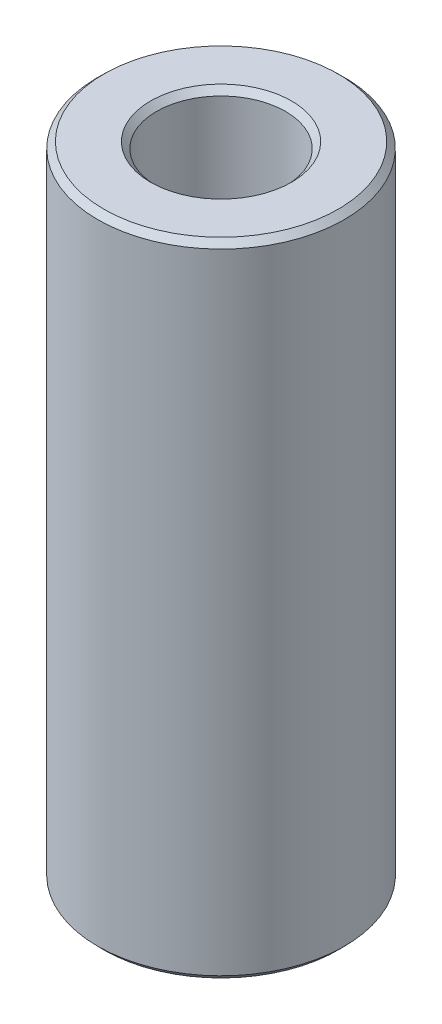
ISO-10303-21;
HEADER;
FILE_DESCRIPTION(('STEP AP214'),'2;1');
FILE_NAME('part.step','',(''),(''),'','','');
FILE_SCHEMA(('AUTOMOTIVE_DESIGN { 1 0 10303 214 1 1 1 1 }'));
ENDSEC;
DATA;
#1=APPLICATION_CONTEXT('core data for automotive mechanical design processes');
#2=APPLICATION_PROTOCOL_DEFINITION('international standard','automotive_design',2000,#1);
#3=PRODUCT_CONTEXT('',#1,'mechanical');
#4=PRODUCT('Part','Part','',(#3));
#5=PRODUCT_RELATED_PRODUCT_CATEGORY('part','',(#4));
#6=PRODUCT_DEFINITION_FORMATION('','',#4);
#7=PRODUCT_DEFINITION_CONTEXT('part definition',#1,'design');
#8=PRODUCT_DEFINITION('design','',#6,#7);
#9=PRODUCT_DEFINITION_SHAPE('','',#8);
#10=(LENGTH_UNIT() NAMED_UNIT(*) SI_UNIT(.MILLI.,.METRE.));
#11=(NAMED_UNIT(*) PLANE_ANGLE_UNIT() SI_UNIT($,.RADIAN.));
#12=(NAMED_UNIT(*) SI_UNIT($,.STERADIAN.) SOLID_ANGLE_UNIT());
#13=UNCERTAINTY_MEASURE_WITH_UNIT(LENGTH_MEASURE(1.E-05),#10,'distance_accuracy_value','');
#14=(GEOMETRIC_REPRESENTATION_CONTEXT(3) GLOBAL_UNCERTAINTY_ASSIGNED_CONTEXT((#13)) GLOBAL_UNIT_ASSIGNED_CONTEXT((#10,
#11,#12)) REPRESENTATION_CONTEXT('',''));
#15=CARTESIAN_POINT('',(0.,0.,0.));
#16=DIRECTION('',(0.,0.,1.));
#17=DIRECTION('',(1.,0.,0.));
#18=AXIS2_PLACEMENT_3D('',#15,#16,#17);
#19=CARTESIAN_POINT('',(0.,52.029353738122,0.));
#20=DIRECTION('',(0.,-1.,0.));
#21=DIRECTION('',(0.,0.,-1.));
#22=AXIS2_PLACEMENT_3D('',#19,#20,#21);
#23=CYLINDRICAL_SURFACE('',#22,10.);
#24=CARTESIAN_POINT('',(0.,0.496036833651431,0.));
#25=DIRECTION('',(0.,1.,0.));
#26=DIRECTION('',(0.,0.,1.));
#27=AXIS2_PLACEMENT_3D('',#24,#25,#26);
#28=CIRCLE('',#27,10.);
#29=CARTESIAN_POINT('',(0.,0.496036833651431,10.));
#30=VERTEX_POINT('',#29);
#31=EDGE_CURVE('E10',#30,#30,#28,.T.);
#32=ORIENTED_EDGE('',*,*,#31,.T.);
#33=EDGE_LOOP('',(#32));
#34=FACE_BOUND('',#33,.T.);
#35=CARTESIAN_POINT('',(0.,51.5460444635213,0.));
#36=DIRECTION('',(0.,1.,0.));
#37=DIRECTION('',(0.,0.,1.));
#38=AXIS2_PLACEMENT_3D('',#35,#36,#37);
#39=CIRCLE('',#38,10.);
#40=CARTESIAN_POINT('',(0.,51.5460444635213,10.));
#41=VERTEX_POINT('',#40);
#42=EDGE_CURVE('E50',#41,#41,#39,.F.);
#43=ORIENTED_EDGE('',*,*,#42,.T.);
#44=EDGE_LOOP('',(#43));
#45=FACE_BOUND('',#44,.T.);
#46=ADVANCED_FACE('F39',(#34,#45),#23,.T.);
#47=CARTESIAN_POINT('',(0.,52.029353738122,0.));
#48=DIRECTION('',(0.,1.,0.));
#49=DIRECTION('',(0.,0.,1.));
#50=AXIS2_PLACEMENT_3D('',#47,#48,#49);
#51=PLANE('',#50);
#52=CARTESIAN_POINT('',(0.,52.029353738122,0.));
#53=DIRECTION('',(0.,1.,0.));
#54=DIRECTION('',(0.,0.,1.));
#55=AXIS2_PLACEMENT_3D('',#52,#53,#54);
#56=CIRCLE('',#55,5.71759016979764);
#57=CARTESIAN_POINT('',(0.,52.029353738122,5.71759016979764));
#58=VERTEX_POINT('',#57);
#59=EDGE_CURVE('E58',#58,#58,#56,.F.);
#60=ORIENTED_EDGE('',*,*,#59,.T.);
#61=EDGE_LOOP('',(#60));
#62=FACE_BOUND('',#61,.T.);
#63=CARTESIAN_POINT('',(0.,52.029353738122,0.));
#64=DIRECTION('',(0.,1.,0.));
#65=DIRECTION('',(0.,0.,1.));
#66=AXIS2_PLACEMENT_3D('',#63,#64,#65);
#67=CIRCLE('',#66,9.50396316634857);
#68=CARTESIAN_POINT('',(0.,52.029353738122,9.50396316634857));
#69=VERTEX_POINT('',#68);
#70=EDGE_CURVE('E61',#69,#69,#67,.T.);
#71=ORIENTED_EDGE('',*,*,#70,.T.);
#72=EDGE_LOOP('',(#71));
#73=FACE_BOUND('',#72,.T.);
#74=ADVANCED_FACE('F88',(#62,#73),#51,.T.);
#75=CARTESIAN_POINT('',(0.,0.,0.));
#76=DIRECTION('',(0.,1.,0.));
#77=DIRECTION('',(0.,0.,1.));
#78=AXIS2_PLACEMENT_3D('',#75,#76,#77);
#79=PLANE('',#78);
#80=CARTESIAN_POINT('',(0.,0.,0.));
#81=DIRECTION('',(0.,1.,0.));
#82=DIRECTION('',(0.,0.,1.));
#83=AXIS2_PLACEMENT_3D('',#80,#81,#82);
#84=CIRCLE('',#83,5.73031772884836);
#85=CARTESIAN_POINT('',(0.,0.,-5.73031772884836));
#86=VERTEX_POINT('',#85);
#87=EDGE_CURVE('E51',#86,#86,#84,.T.);
#88=ORIENTED_EDGE('',*,*,#87,.T.);
#89=EDGE_LOOP('',(#88));
#90=FACE_BOUND('',#89,.T.);
#91=CARTESIAN_POINT('',(0.,0.,0.));
#92=DIRECTION('',(0.,1.,0.));
#93=DIRECTION('',(0.,0.,1.));
#94=AXIS2_PLACEMENT_3D('',#91,#92,#93);
#95=CIRCLE('',#94,9.51669072539929);
#96=CARTESIAN_POINT('',(0.,0.,9.51669072539929));
#97=VERTEX_POINT('',#96);
#98=EDGE_CURVE('E54',#97,#97,#95,.F.);
#99=ORIENTED_EDGE('',*,*,#98,.T.);
#100=EDGE_LOOP('',(#99));
#101=FACE_BOUND('',#100,.T.);
#102=ADVANCED_FACE('F83',(#90,#101),#79,.F.);
#103=CARTESIAN_POINT('',(0.,52.029353738122,0.));
#104=DIRECTION('',(0.,-1.,0.));
#105=DIRECTION('',(0.,0.,-1.));
#106=AXIS2_PLACEMENT_3D('',#103,#104,#105);
#107=CYLINDRICAL_SURFACE('',#106,5.23428089519693);
#108=CARTESIAN_POINT('',(0.,51.5333169044706,0.));
#109=DIRECTION('',(0.,1.,0.));
#110=DIRECTION('',(0.,0.,1.));
#111=AXIS2_PLACEMENT_3D('',#108,#109,#110);
#112=CIRCLE('',#111,5.23428089519693);
#113=CARTESIAN_POINT('',(0.,51.5333169044706,5.23428089519693));
#114=VERTEX_POINT('',#113);
#115=EDGE_CURVE('E67',#114,#114,#112,.T.);
#116=ORIENTED_EDGE('',*,*,#115,.T.);
#117=EDGE_LOOP('',(#116));
#118=FACE_BOUND('',#117,.T.);
#119=CARTESIAN_POINT('',(0.,0.483309274600704,0.));
#120=DIRECTION('',(0.,1.,0.));
#121=DIRECTION('',(0.,0.,1.));
#122=AXIS2_PLACEMENT_3D('',#119,#120,#121);
#123=CIRCLE('',#122,5.23428089519693);
#124=CARTESIAN_POINT('',(0.,0.483309274600704,-5.23428089519693));
#125=VERTEX_POINT('',#124);
#126=EDGE_CURVE('E69',#125,#125,#123,.F.);
#127=ORIENTED_EDGE('',*,*,#126,.T.);
#128=EDGE_LOOP('',(#127));
#129=FACE_BOUND('',#128,.T.);
#130=ADVANCED_FACE('F71',(#118,#129),#107,.F.);
#131=CARTESIAN_POINT('',(0.,51.5333169044706,0.));
#132=DIRECTION('',(0.,1.,0.));
#133=DIRECTION('',(0.,0.,1.));
#134=AXIS2_PLACEMENT_3D('',#131,#132,#133);
#135=CONICAL_SURFACE('',#134,5.23428089519693,0.772402918433484);
#136=ORIENTED_EDGE('',*,*,#59,.F.);
#137=EDGE_LOOP('',(#136));
#138=FACE_BOUND('',#137,.T.);
#139=ORIENTED_EDGE('',*,*,#115,.F.);
#140=EDGE_LOOP('',(#139));
#141=FACE_BOUND('',#140,.T.);
#142=ADVANCED_FACE('F77',(#138,#141),#135,.F.);
#143=CARTESIAN_POINT('',(0.,0.,0.));
#144=DIRECTION('',(0.,-1.,0.));
#145=DIRECTION('',(0.,0.,-1.));
#146=AXIS2_PLACEMENT_3D('',#143,#144,#145);
#147=CONICAL_SURFACE('',#146,5.73031772884836,0.798393408361418);
#148=CARTESIAN_POINT('',(0.,0.483309274600704,-5.23428089519693));
#149=CARTESIAN_POINT('',(0.,0.47827480299028,-5.23944794554746));
#150=CARTESIAN_POINT('',(0.,0.473240331379856,-5.244614995898));
#151=CARTESIAN_POINT('',(0.,0.463171388159008,-5.25494909659907));
#152=CARTESIAN_POINT('',(0.,0.458136916548584,-5.26011614694961));
#153=CARTESIAN_POINT('',(0.,0.448067973327736,-5.27045024765068));
#154=CARTESIAN_POINT('',(0.,0.443033501717312,-5.27561729800121));
#155=CARTESIAN_POINT('',(0.,0.432964558496464,-5.28595139870229));
#156=CARTESIAN_POINT('',(0.,0.42793008688604,-5.29111844905282));
#157=CARTESIAN_POINT('',(0.,0.417861143665192,-5.30145254975389));
#158=CARTESIAN_POINT('',(0.,0.412826672054768,-5.30661960010443));
#159=CARTESIAN_POINT('',(0.,0.40275772883392,-5.3169537008055));
#160=CARTESIAN_POINT('',(0.,0.397723257223496,-5.32212075115604));
#161=CARTESIAN_POINT('',(0.,0.387654314002648,-5.33245485185711));
#162=CARTESIAN_POINT('',(0.,0.382619842392224,-5.33762190220764));
#163=CARTESIAN_POINT('',(0.,0.372550899171376,-5.34795600290872));
#164=CARTESIAN_POINT('',(0.,0.367516427560952,-5.35312305325925));
#165=CARTESIAN_POINT('',(0.,0.357447484340104,-5.36345715396032));
#166=CARTESIAN_POINT('',(0.,0.35241301272968,-5.36862420431086));
#167=CARTESIAN_POINT('',(0.,0.342344069508832,-5.37895830501193));
#168=CARTESIAN_POINT('',(0.,0.337309597898408,-5.38412535536247));
#169=CARTESIAN_POINT('',(0.,0.32724065467756,-5.39445945606354));
#170=CARTESIAN_POINT('',(0.,0.322206183067136,-5.39962650641407));
#171=CARTESIAN_POINT('',(0.,0.312137239846288,-5.40996060711514));
#172=CARTESIAN_POINT('',(0.,0.307102768235864,-5.41512765746568));
#173=CARTESIAN_POINT('',(0.,0.297033825015016,-5.42546175816675));
#174=CARTESIAN_POINT('',(0.,0.291999353404592,-5.43062880851729));
#175=CARTESIAN_POINT('',(0.,0.281930410183744,-5.44096290921836));
#176=CARTESIAN_POINT('',(0.,0.27689593857332,-5.44612995956889));
#177=CARTESIAN_POINT('',(0.,0.266826995352472,-5.45646406026997));
#178=CARTESIAN_POINT('',(0.,0.261792523742048,-5.4616311106205));
#179=CARTESIAN_POINT('',(0.,0.2517235805212,-5.47196521132157));
#180=CARTESIAN_POINT('',(0.,0.246689108910776,-5.47713226167211));
#181=CARTESIAN_POINT('',(0.,0.236620165689928,-5.48746636237318));
#182=CARTESIAN_POINT('',(0.,0.231585694079504,-5.49263341272372));
#183=CARTESIAN_POINT('',(0.,0.221516750858656,-5.50296751342479));
#184=CARTESIAN_POINT('',(0.,0.216482279248232,-5.50813456377532));
#185=CARTESIAN_POINT('',(0.,0.206413336027384,-5.5184686644764));
#186=CARTESIAN_POINT('',(0.,0.20137886441696,-5.52363571482693));
#187=CARTESIAN_POINT('',(0.,0.191309921196112,-5.533969815528));
#188=CARTESIAN_POINT('',(0.,0.186275449585688,-5.53913686587854));
#189=CARTESIAN_POINT('',(0.,0.17620650636484,-5.54947096657961));
#190=CARTESIAN_POINT('',(0.,0.171172034754416,-5.55463801693015));
#191=CARTESIAN_POINT('',(0.,0.161103091533568,-5.56497211763122));
#192=CARTESIAN_POINT('',(0.,0.156068619923144,-5.57013916798175));
#193=CARTESIAN_POINT('',(0.,0.145999676702296,-5.58047326868282));
#194=CARTESIAN_POINT('',(0.,0.140965205091872,-5.58564031903336));
#195=CARTESIAN_POINT('',(0.,0.130896261871024,-5.59597441973443));
#196=CARTESIAN_POINT('',(0.,0.1258617902606,-5.60114147008497));
#197=CARTESIAN_POINT('',(0.,0.115792847039752,-5.61147557078604));
#198=CARTESIAN_POINT('',(0.,0.110758375429328,-5.61664262113657));
#199=CARTESIAN_POINT('',(0.,0.10068943220848,-5.62697672183765));
#200=CARTESIAN_POINT('',(0.,0.095654960598056,-5.63214377218818));
#201=CARTESIAN_POINT('',(0.,0.085586017377208,-5.64247787288925));
#202=CARTESIAN_POINT('',(0.,0.0805515457667841,-5.64764492323979));
#203=CARTESIAN_POINT('',(0.,0.0704826025459361,-5.65797902394086));
#204=CARTESIAN_POINT('',(0.,0.0654481309355121,-5.6631460742914));
#205=CARTESIAN_POINT('',(0.,0.055379187714664,-5.67348017499247));
#206=CARTESIAN_POINT('',(0.,0.05034471610424,-5.678647225343));
#207=CARTESIAN_POINT('',(0.,0.040275772883392,-5.68898132604408));
#208=CARTESIAN_POINT('',(0.,0.035241301272968,-5.69414837639461));
#209=CARTESIAN_POINT('',(0.,0.02517235805212,-5.70448247709568));
#210=CARTESIAN_POINT('',(0.,0.020137886441696,-5.70964952744622));
#211=CARTESIAN_POINT('',(0.,0.010068943220848,-5.71998362814729));
#212=CARTESIAN_POINT('',(0.,0.005034471610424,-5.72515067849783));
#213=CARTESIAN_POINT('',(0.,0.,-5.73031772884836));
#214=B_SPLINE_CURVE_WITH_KNOTS('',3,(#148,#149,#150,#151,#152,#153,#154,#155,#156,#157,#158,
#159,#160,#161,#162,#163,#164,#165,#166,#167,#168,#169,#170,#171,#172,#173,#174,#175,#176,#177,
#178,#179,#180,#181,#182,#183,#184,#185,#186,#187,#188,#189,#190,#191,#192,#193,#194,#195,#196,
#197,#198,#199,#200,#201,#202,#203,#204,#205,#206,#207,#208,#209,#210,#211,#212,#213),
.UNSPECIFIED.,.F.,.F.,(4,2,2,2,2,2,2,2,2,2,2,2,2,2,2,2,2,2,2,2,2,2,2,2,2,2,2,2,2,2,2,2,4),(0.,
0.0216425235009744,0.0432850470019489,0.0649275705029233,0.0865700940038978,0.108212617504873,
0.129855141005847,0.151497664506822,0.173140188007796,0.194782711508771,0.216425235009745,
0.238067758510719,0.259710282011694,0.281352805512668,0.302995329013643,0.324637852514617,
0.346280376015592,0.367922899516567,0.389565423017541,0.411207946518516,0.43285047001949,
0.454492993520465,0.476135517021439,0.497778040522413,0.519420564023388,0.541063087524362,
0.562705611025337,0.584348134526312,0.605990658027286,0.627633181528261,0.649275705029235,
0.67091822853021,0.692560752031184),.UNSPECIFIED.);
#215=EDGE_CURVE('BSEAM73',#125,#86,#214,.T.);
#216=ORIENTED_EDGE('',*,*,#126,.F.);
#217=ORIENTED_EDGE('',*,*,#87,.F.);
#218=ORIENTED_EDGE('',*,*,#215,.T.);
#219=ORIENTED_EDGE('',*,*,#215,.F.);
#220=EDGE_LOOP('',(#216,#218,#217,#219));
#221=FACE_BOUND('',#220,.T.);
#222=ADVANCED_FACE('F73',(#221),#147,.F.);
#223=CARTESIAN_POINT('',(0.,0.496036833651431,0.));
#224=DIRECTION('',(0.,1.,0.));
#225=DIRECTION('',(0.,0.,1.));
#226=AXIS2_PLACEMENT_3D('',#223,#224,#225);
#227=CONICAL_SURFACE('',#226,10.,0.772402918433488);
#228=ORIENTED_EDGE('',*,*,#98,.F.);
#229=EDGE_LOOP('',(#228));
#230=FACE_BOUND('',#229,.T.);
#231=ORIENTED_EDGE('',*,*,#31,.F.);
#232=EDGE_LOOP('',(#231));
#233=FACE_BOUND('',#232,.T.);
#234=ADVANCED_FACE('F76',(#230,#233),#227,.T.);
#235=CARTESIAN_POINT('',(0.,52.029353738122,0.));
#236=DIRECTION('',(0.,-1.,0.));
#237=DIRECTION('',(0.,0.,-1.));
#238=AXIS2_PLACEMENT_3D('',#235,#236,#237);
#239=CONICAL_SURFACE('',#238,9.50396316634857,0.798393408361408);
#240=ORIENTED_EDGE('',*,*,#42,.F.);
#241=EDGE_LOOP('',(#240));
#242=FACE_BOUND('',#241,.T.);
#243=ORIENTED_EDGE('',*,*,#70,.F.);
#244=EDGE_LOOP('',(#243));
#245=FACE_BOUND('',#244,.T.);
#246=ADVANCED_FACE('F45',(#242,#245),#239,.T.);
#247=CLOSED_SHELL('',(#46,#74,#102,#130,#142,#222,#234,#246));
#248=MANIFOLD_SOLID_BREP('B2',#247);
#249=ADVANCED_BREP_SHAPE_REPRESENTATION('',(#18,#248),#14);
#250=SHAPE_DEFINITION_REPRESENTATION(#9,#249);
ENDSEC;
END-ISO-10303-21;
